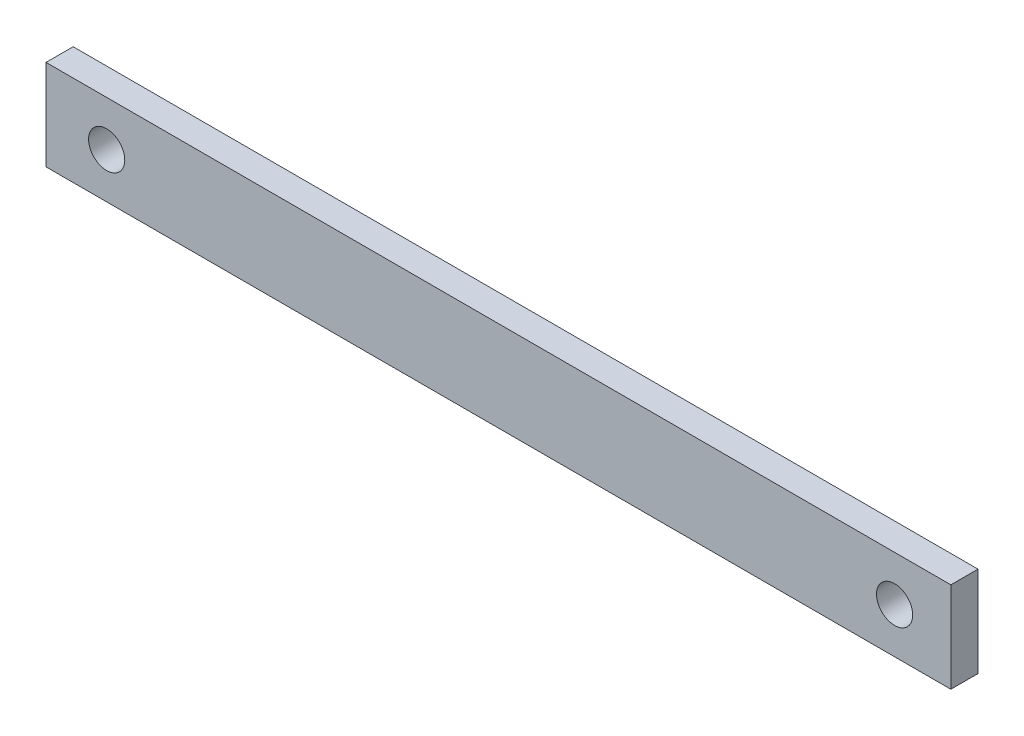
ISO-10303-21;
HEADER;
FILE_DESCRIPTION(('STEP AP214'),'2;1');
FILE_NAME('part.step','',(''),(''),'','','');
FILE_SCHEMA(('AUTOMOTIVE_DESIGN { 1 0 10303 214 1 1 1 1 }'));
ENDSEC;
DATA;
#1=APPLICATION_CONTEXT('core data for automotive mechanical design processes');
#2=APPLICATION_PROTOCOL_DEFINITION('international standard','automotive_design',2000,#1);
#3=PRODUCT_CONTEXT('',#1,'mechanical');
#4=PRODUCT('Part','Part','',(#3));
#5=PRODUCT_RELATED_PRODUCT_CATEGORY('part','',(#4));
#6=PRODUCT_DEFINITION_FORMATION('','',#4);
#7=PRODUCT_DEFINITION_CONTEXT('part definition',#1,'design');
#8=PRODUCT_DEFINITION('design','',#6,#7);
#9=PRODUCT_DEFINITION_SHAPE('','',#8);
#10=(LENGTH_UNIT() NAMED_UNIT(*) SI_UNIT(.MILLI.,.METRE.));
#11=(NAMED_UNIT(*) PLANE_ANGLE_UNIT() SI_UNIT($,.RADIAN.));
#12=(NAMED_UNIT(*) SI_UNIT($,.STERADIAN.) SOLID_ANGLE_UNIT());
#13=UNCERTAINTY_MEASURE_WITH_UNIT(LENGTH_MEASURE(1.E-05),#10,'distance_accuracy_value','');
#14=(GEOMETRIC_REPRESENTATION_CONTEXT(3) GLOBAL_UNCERTAINTY_ASSIGNED_CONTEXT((#13)) GLOBAL_UNIT_ASSIGNED_CONTEXT((#10,
#11,#12)) REPRESENTATION_CONTEXT('',''));
#15=CARTESIAN_POINT('',(0.,0.,0.));
#16=DIRECTION('',(0.,0.,1.));
#17=DIRECTION('',(1.,0.,0.));
#18=AXIS2_PLACEMENT_3D('',#15,#16,#17);
#19=CARTESIAN_POINT('',(50.,5.,3.));
#20=DIRECTION('',(-1.,0.,0.));
#21=DIRECTION('',(0.,0.,1.));
#22=AXIS2_PLACEMENT_3D('',#19,#20,#21);
#23=PLANE('',#22);
#24=DIRECTION('',(0.,1.,0.));
#25=VECTOR('',#24,1.);
#26=CARTESIAN_POINT('',(50.,5.,0.));
#27=LINE('',#26,#25);
#28=CARTESIAN_POINT('',(50.,-5.,0.));
#29=VERTEX_POINT('',#28);
#30=CARTESIAN_POINT('',(50.,5.,0.));
#31=VERTEX_POINT('',#30);
#32=EDGE_CURVE('E99',#29,#31,#27,.T.);
#33=ORIENTED_EDGE('',*,*,#32,.T.);
#34=DIRECTION('',(0.,0.,-1.));
#35=VECTOR('',#34,1.);
#36=CARTESIAN_POINT('',(50.,5.,3.));
#37=LINE('',#36,#35);
#38=CARTESIAN_POINT('',(50.,5.,3.));
#39=VERTEX_POINT('',#38);
#40=EDGE_CURVE('E11',#39,#31,#37,.T.);
#41=ORIENTED_EDGE('',*,*,#40,.F.);
#42=DIRECTION('',(0.,1.,0.));
#43=VECTOR('',#42,1.);
#44=CARTESIAN_POINT('',(50.,5.,3.));
#45=LINE('',#44,#43);
#46=CARTESIAN_POINT('',(50.,-5.,3.));
#47=VERTEX_POINT('',#46);
#48=EDGE_CURVE('E86',#47,#39,#45,.T.);
#49=ORIENTED_EDGE('',*,*,#48,.F.);
#50=DIRECTION('',(0.,0.,-1.));
#51=VECTOR('',#50,1.);
#52=CARTESIAN_POINT('',(50.,-5.,3.));
#53=LINE('',#52,#51);
#54=EDGE_CURVE('E95',#47,#29,#53,.T.);
#55=ORIENTED_EDGE('',*,*,#54,.T.);
#56=EDGE_LOOP('',(#33,#41,#49,#55));
#57=FACE_BOUND('',#56,.T.);
#58=ADVANCED_FACE('F33',(#57),#23,.F.);
#59=CARTESIAN_POINT('',(-50.,5.,3.));
#60=DIRECTION('',(0.,-1.,0.));
#61=DIRECTION('',(0.,0.,-1.));
#62=AXIS2_PLACEMENT_3D('',#59,#60,#61);
#63=PLANE('',#62);
#64=DIRECTION('',(-1.,0.,0.));
#65=VECTOR('',#64,1.);
#66=CARTESIAN_POINT('',(-50.,5.,0.));
#67=LINE('',#66,#65);
#68=CARTESIAN_POINT('',(-50.,5.,0.));
#69=VERTEX_POINT('',#68);
#70=EDGE_CURVE('E90',#31,#69,#67,.T.);
#71=ORIENTED_EDGE('',*,*,#70,.T.);
#72=DIRECTION('',(0.,0.,-1.));
#73=VECTOR('',#72,1.);
#74=CARTESIAN_POINT('',(-50.,5.,3.));
#75=LINE('',#74,#73);
#76=CARTESIAN_POINT('',(-50.,5.,3.));
#77=VERTEX_POINT('',#76);
#78=EDGE_CURVE('E42',#77,#69,#75,.T.);
#79=ORIENTED_EDGE('',*,*,#78,.F.);
#80=DIRECTION('',(-1.,0.,0.));
#81=VECTOR('',#80,1.);
#82=CARTESIAN_POINT('',(-50.,5.,3.));
#83=LINE('',#82,#81);
#84=EDGE_CURVE('E81',#39,#77,#83,.T.);
#85=ORIENTED_EDGE('',*,*,#84,.F.);
#86=ORIENTED_EDGE('',*,*,#40,.T.);
#87=EDGE_LOOP('',(#71,#79,#85,#86));
#88=FACE_BOUND('',#87,.T.);
#89=ADVANCED_FACE('F89',(#88),#63,.F.);
#90=CARTESIAN_POINT('',(-50.,5.,3.));
#91=DIRECTION('',(1.,0.,0.));
#92=DIRECTION('',(0.,0.,-1.));
#93=AXIS2_PLACEMENT_3D('',#90,#91,#92);
#94=PLANE('',#93);
#95=DIRECTION('',(0.,-1.,0.));
#96=VECTOR('',#95,1.);
#97=CARTESIAN_POINT('',(-50.,5.,0.));
#98=LINE('',#97,#96);
#99=CARTESIAN_POINT('',(-50.,-5.,0.));
#100=VERTEX_POINT('',#99);
#101=EDGE_CURVE('E68',#69,#100,#98,.T.);
#102=ORIENTED_EDGE('',*,*,#101,.T.);
#103=DIRECTION('',(0.,0.,-1.));
#104=VECTOR('',#103,1.);
#105=CARTESIAN_POINT('',(-50.,-5.,3.));
#106=LINE('',#105,#104);
#107=CARTESIAN_POINT('',(-50.,-5.,3.));
#108=VERTEX_POINT('',#107);
#109=EDGE_CURVE('E91',#108,#100,#106,.T.);
#110=ORIENTED_EDGE('',*,*,#109,.F.);
#111=DIRECTION('',(0.,-1.,0.));
#112=VECTOR('',#111,1.);
#113=CARTESIAN_POINT('',(-50.,5.,3.));
#114=LINE('',#113,#112);
#115=EDGE_CURVE('E84',#77,#108,#114,.T.);
#116=ORIENTED_EDGE('',*,*,#115,.F.);
#117=ORIENTED_EDGE('',*,*,#78,.T.);
#118=EDGE_LOOP('',(#102,#110,#116,#117));
#119=FACE_BOUND('',#118,.T.);
#120=ADVANCED_FACE('F93',(#119),#94,.F.);
#121=CARTESIAN_POINT('',(-50.,-5.,3.));
#122=DIRECTION('',(0.,1.,0.));
#123=DIRECTION('',(0.,0.,1.));
#124=AXIS2_PLACEMENT_3D('',#121,#122,#123);
#125=PLANE('',#124);
#126=DIRECTION('',(1.,0.,0.));
#127=VECTOR('',#126,1.);
#128=CARTESIAN_POINT('',(-50.,-5.,0.));
#129=LINE('',#128,#127);
#130=EDGE_CURVE('E74',#100,#29,#129,.T.);
#131=ORIENTED_EDGE('',*,*,#130,.T.);
#132=ORIENTED_EDGE('',*,*,#54,.F.);
#133=DIRECTION('',(1.,0.,0.));
#134=VECTOR('',#133,1.);
#135=CARTESIAN_POINT('',(-50.,-5.,3.));
#136=LINE('',#135,#134);
#137=EDGE_CURVE('E51',#108,#47,#136,.T.);
#138=ORIENTED_EDGE('',*,*,#137,.F.);
#139=ORIENTED_EDGE('',*,*,#109,.T.);
#140=EDGE_LOOP('',(#131,#132,#138,#139));
#141=FACE_BOUND('',#140,.T.);
#142=ADVANCED_FACE('F126',(#141),#125,.F.);
#143=CARTESIAN_POINT('',(0.,0.,3.));
#144=DIRECTION('',(0.,0.,1.));
#145=DIRECTION('',(1.,0.,0.));
#146=AXIS2_PLACEMENT_3D('',#143,#144,#145);
#147=PLANE('',#146);
#148=CARTESIAN_POINT('',(-43.2952817071666,0.,3.));
#149=DIRECTION('',(0.,0.,1.));
#150=DIRECTION('',(1.,0.,0.));
#151=AXIS2_PLACEMENT_3D('',#148,#149,#150);
#152=CIRCLE('',#151,2.);
#153=CARTESIAN_POINT('',(-41.2952817071666,0.,3.));
#154=VERTEX_POINT('',#153);
#155=EDGE_CURVE('E108',#154,#154,#152,.T.);
#156=ORIENTED_EDGE('',*,*,#155,.F.);
#157=EDGE_LOOP('',(#156));
#158=FACE_BOUND('',#157,.T.);
#159=CARTESIAN_POINT('',(43.7828829823133,0.,3.));
#160=DIRECTION('',(0.,0.,1.));
#161=DIRECTION('',(1.,0.,0.));
#162=AXIS2_PLACEMENT_3D('',#159,#160,#161);
#163=CIRCLE('',#162,2.);
#164=CARTESIAN_POINT('',(45.7828829823133,0.,3.));
#165=VERTEX_POINT('',#164);
#166=EDGE_CURVE('E113',#165,#165,#163,.T.);
#167=ORIENTED_EDGE('',*,*,#166,.F.);
#168=EDGE_LOOP('',(#167));
#169=FACE_BOUND('',#168,.T.);
#170=ORIENTED_EDGE('',*,*,#48,.T.);
#171=ORIENTED_EDGE('',*,*,#84,.T.);
#172=ORIENTED_EDGE('',*,*,#115,.T.);
#173=ORIENTED_EDGE('',*,*,#137,.T.);
#174=EDGE_LOOP('',(#170,#171,#172,#173));
#175=FACE_BOUND('',#174,.T.);
#176=ADVANCED_FACE('F82',(#158,#169,#175),#147,.T.);
#177=CARTESIAN_POINT('',(0.,0.,0.));
#178=DIRECTION('',(0.,0.,1.));
#179=DIRECTION('',(1.,0.,0.));
#180=AXIS2_PLACEMENT_3D('',#177,#178,#179);
#181=PLANE('',#180);
#182=CARTESIAN_POINT('',(-43.2952817071666,0.,0.));
#183=DIRECTION('',(0.,0.,1.));
#184=DIRECTION('',(1.,0.,0.));
#185=AXIS2_PLACEMENT_3D('',#182,#183,#184);
#186=CIRCLE('',#185,2.);
#187=CARTESIAN_POINT('',(-41.2952817071666,0.,0.));
#188=VERTEX_POINT('',#187);
#189=EDGE_CURVE('E36',#188,#188,#186,.T.);
#190=ORIENTED_EDGE('',*,*,#189,.T.);
#191=EDGE_LOOP('',(#190));
#192=FACE_BOUND('',#191,.T.);
#193=CARTESIAN_POINT('',(43.7828829823133,0.,0.));
#194=DIRECTION('',(0.,0.,1.));
#195=DIRECTION('',(1.,0.,0.));
#196=AXIS2_PLACEMENT_3D('',#193,#194,#195);
#197=CIRCLE('',#196,2.);
#198=CARTESIAN_POINT('',(45.7828829823133,0.,0.));
#199=VERTEX_POINT('',#198);
#200=EDGE_CURVE('E106',#199,#199,#197,.T.);
#201=ORIENTED_EDGE('',*,*,#200,.T.);
#202=EDGE_LOOP('',(#201));
#203=FACE_BOUND('',#202,.T.);
#204=ORIENTED_EDGE('',*,*,#32,.F.);
#205=ORIENTED_EDGE('',*,*,#130,.F.);
#206=ORIENTED_EDGE('',*,*,#101,.F.);
#207=ORIENTED_EDGE('',*,*,#70,.F.);
#208=EDGE_LOOP('',(#204,#205,#206,#207));
#209=FACE_BOUND('',#208,.T.);
#210=ADVANCED_FACE('F125',(#192,#203,#209),#181,.F.);
#211=CARTESIAN_POINT('',(43.7828829823133,0.,-7.));
#212=DIRECTION('',(0.,0.,1.));
#213=DIRECTION('',(1.,0.,0.));
#214=AXIS2_PLACEMENT_3D('',#211,#212,#213);
#215=CYLINDRICAL_SURFACE('',#214,2.);
#216=ORIENTED_EDGE('',*,*,#166,.T.);
#217=EDGE_LOOP('',(#216));
#218=FACE_BOUND('',#217,.T.);
#219=ORIENTED_EDGE('',*,*,#200,.F.);
#220=EDGE_LOOP('',(#219));
#221=FACE_BOUND('',#220,.T.);
#222=ADVANCED_FACE('F121',(#218,#221),#215,.F.);
#223=CARTESIAN_POINT('',(-43.2952817071666,0.,-7.));
#224=DIRECTION('',(0.,0.,1.));
#225=DIRECTION('',(1.,0.,0.));
#226=AXIS2_PLACEMENT_3D('',#223,#224,#225);
#227=CYLINDRICAL_SURFACE('',#226,2.);
#228=ORIENTED_EDGE('',*,*,#155,.T.);
#229=EDGE_LOOP('',(#228));
#230=FACE_BOUND('',#229,.T.);
#231=ORIENTED_EDGE('',*,*,#189,.F.);
#232=EDGE_LOOP('',(#231));
#233=FACE_BOUND('',#232,.T.);
#234=ADVANCED_FACE('F171',(#230,#233),#227,.F.);
#235=CLOSED_SHELL('',(#58,#89,#120,#142,#176,#210,#222,#234));
#236=MANIFOLD_SOLID_BREP('B2',#235);
#237=ADVANCED_BREP_SHAPE_REPRESENTATION('',(#18,#236),#14);
#238=SHAPE_DEFINITION_REPRESENTATION(#9,#237);
ENDSEC;
END-ISO-10303-21;
